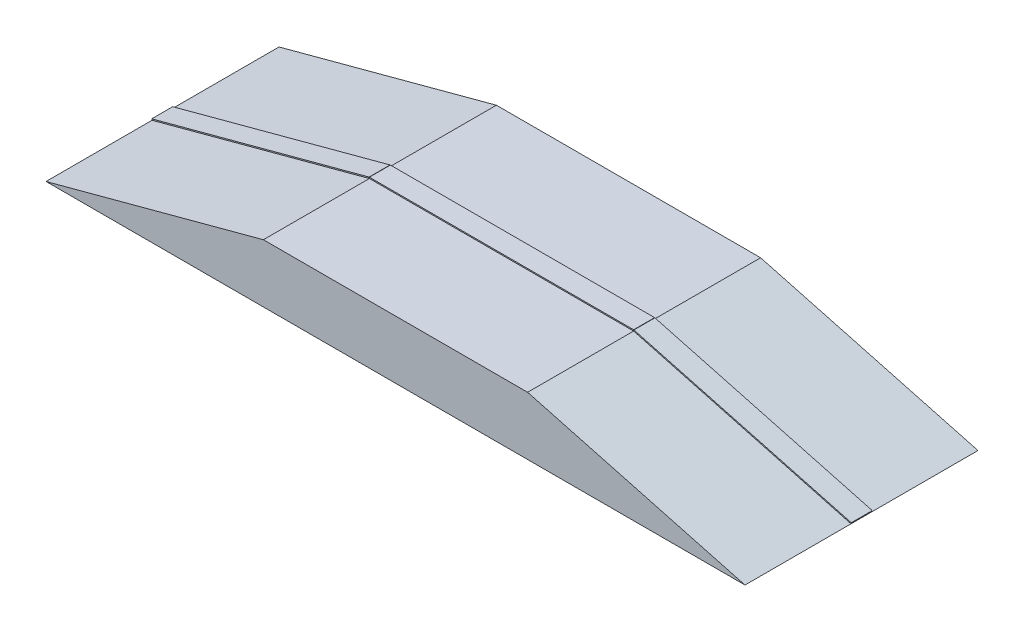
ISO-10303-21;
HEADER;
FILE_DESCRIPTION(('STEP AP214'),'2;1');
FILE_NAME('part.step','',(''),(''),'','','');
FILE_SCHEMA(('AUTOMOTIVE_DESIGN { 1 0 10303 214 1 1 1 1 }'));
ENDSEC;
DATA;
#1=APPLICATION_CONTEXT('core data for automotive mechanical design processes');
#2=APPLICATION_PROTOCOL_DEFINITION('international standard','automotive_design',2000,#1);
#3=PRODUCT_CONTEXT('',#1,'mechanical');
#4=PRODUCT('Part','Part','',(#3));
#5=PRODUCT_RELATED_PRODUCT_CATEGORY('part','',(#4));
#6=PRODUCT_DEFINITION_FORMATION('','',#4);
#7=PRODUCT_DEFINITION_CONTEXT('part definition',#1,'design');
#8=PRODUCT_DEFINITION('design','',#6,#7);
#9=PRODUCT_DEFINITION_SHAPE('','',#8);
#10=(LENGTH_UNIT() NAMED_UNIT(*) SI_UNIT(.MILLI.,.METRE.));
#11=(NAMED_UNIT(*) PLANE_ANGLE_UNIT() SI_UNIT($,.RADIAN.));
#12=(NAMED_UNIT(*) SI_UNIT($,.STERADIAN.) SOLID_ANGLE_UNIT());
#13=UNCERTAINTY_MEASURE_WITH_UNIT(LENGTH_MEASURE(1.E-05),#10,'distance_accuracy_value','');
#14=(GEOMETRIC_REPRESENTATION_CONTEXT(3) GLOBAL_UNCERTAINTY_ASSIGNED_CONTEXT((#13)) GLOBAL_UNIT_ASSIGNED_CONTEXT((#10,
#11,#12)) REPRESENTATION_CONTEXT('',''));
#15=CARTESIAN_POINT('',(0.,0.,0.));
#16=DIRECTION('',(0.,0.,1.));
#17=DIRECTION('',(1.,0.,0.));
#18=AXIS2_PLACEMENT_3D('',#15,#16,#17);
#19=CARTESIAN_POINT('',(186.343721333346,50.965925826289,-8.99999999999993));
#20=DIRECTION('',(-0.96592582628907,-0.258819045102515,0.));
#21=DIRECTION('',(0.258819045102515,-0.96592582628907,0.));
#22=AXIS2_PLACEMENT_3D('',#19,#20,#21);
#23=PLANE('',#22);
#24=DIRECTION('',(0.,0.,-1.));
#25=VECTOR('',#24,1.);
#26=CARTESIAN_POINT('',(186.602540378448,49.9999999999999,-8.99999999999993));
#27=LINE('',#26,#25);
#28=CARTESIAN_POINT('',(186.602540378448,49.9999999999999,9.00000000000008));
#29=VERTEX_POINT('',#28);
#30=CARTESIAN_POINT('',(186.602540378448,49.9999999999999,-8.99999999999993));
#31=VERTEX_POINT('',#30);
#32=EDGE_CURVE('E108',#29,#31,#27,.T.);
#33=ORIENTED_EDGE('',*,*,#32,.T.);
#34=DIRECTION('',(0.258819045102515,-0.96592582628907,0.));
#35=VECTOR('',#34,1.);
#36=CARTESIAN_POINT('',(186.343721333346,50.965925826289,-8.99999999999993));
#37=LINE('',#36,#35);
#38=CARTESIAN_POINT('',(186.343721333346,50.965925826289,-8.99999999999993));
#39=VERTEX_POINT('',#38);
#40=EDGE_CURVE('E12',#39,#31,#37,.T.);
#41=ORIENTED_EDGE('',*,*,#40,.F.);
#42=DIRECTION('',(0.,0.,-1.));
#43=VECTOR('',#42,1.);
#44=CARTESIAN_POINT('',(186.343721333346,50.965925826289,-8.99999999999993));
#45=LINE('',#44,#43);
#46=CARTESIAN_POINT('',(186.343721333346,50.965925826289,9.00000000000008));
#47=VERTEX_POINT('',#46);
#48=EDGE_CURVE('E96',#47,#39,#45,.T.);
#49=ORIENTED_EDGE('',*,*,#48,.F.);
#50=DIRECTION('',(0.258819045102515,-0.96592582628907,0.));
#51=VECTOR('',#50,1.);
#52=CARTESIAN_POINT('',(186.343721333346,50.965925826289,9.00000000000008));
#53=LINE('',#52,#51);
#54=EDGE_CURVE('E104',#47,#29,#53,.T.);
#55=ORIENTED_EDGE('',*,*,#54,.T.);
#56=EDGE_LOOP('',(#33,#41,#49,#55));
#57=FACE_BOUND('',#56,.T.);
#58=ADVANCED_FACE('F45',(#57),#23,.F.);
#59=CARTESIAN_POINT('',(186.343721333346,50.965925826289,-8.99999999999993));
#60=DIRECTION('',(0.,0.,1.));
#61=DIRECTION('',(1.,0.,0.));
#62=AXIS2_PLACEMENT_3D('',#59,#60,#61);
#63=PLANE('',#62);
#64=DIRECTION('',(-0.96592582628907,-0.258819045102515,0.));
#65=VECTOR('',#64,1.);
#66=CARTESIAN_POINT('',(186.602540378448,49.9999999999999,-8.99999999999993));
#67=LINE('',#66,#65);
#68=CARTESIAN_POINT('',(0.,0.,-8.9999999999999));
#69=VERTEX_POINT('',#68);
#70=EDGE_CURVE('E100',#31,#69,#67,.T.);
#71=ORIENTED_EDGE('',*,*,#70,.T.);
#72=DIRECTION('',(0.258819045102515,-0.96592582628907,0.));
#73=VECTOR('',#72,1.);
#74=CARTESIAN_POINT('',(-0.258819045102515,0.96592582628907,-8.9999999999999));
#75=LINE('',#74,#73);
#76=CARTESIAN_POINT('',(-0.258819045102515,0.96592582628907,-8.9999999999999));
#77=VERTEX_POINT('',#76);
#78=EDGE_CURVE('E53',#77,#69,#75,.T.);
#79=ORIENTED_EDGE('',*,*,#78,.F.);
#80=DIRECTION('',(-0.96592582628907,-0.258819045102515,0.));
#81=VECTOR('',#80,1.);
#82=CARTESIAN_POINT('',(186.343721333346,50.965925826289,-8.99999999999993));
#83=LINE('',#82,#81);
#84=EDGE_CURVE('E91',#39,#77,#83,.T.);
#85=ORIENTED_EDGE('',*,*,#84,.F.);
#86=ORIENTED_EDGE('',*,*,#40,.T.);
#87=EDGE_LOOP('',(#71,#79,#85,#86));
#88=FACE_BOUND('',#87,.T.);
#89=ADVANCED_FACE('F99',(#88),#63,.F.);
#90=CARTESIAN_POINT('',(-0.258819045102515,0.96592582628907,-8.9999999999999));
#91=DIRECTION('',(0.96592582628907,0.258819045102515,0.));
#92=DIRECTION('',(-0.258819045102515,0.96592582628907,0.));
#93=AXIS2_PLACEMENT_3D('',#90,#91,#92);
#94=PLANE('',#93);
#95=DIRECTION('',(0.,0.,1.));
#96=VECTOR('',#95,1.);
#97=CARTESIAN_POINT('',(0.,0.,-8.9999999999999));
#98=LINE('',#97,#96);
#99=CARTESIAN_POINT('',(0.,0.,9.0000000000001));
#100=VERTEX_POINT('',#99);
#101=EDGE_CURVE('E78',#69,#100,#98,.T.);
#102=ORIENTED_EDGE('',*,*,#101,.T.);
#103=DIRECTION('',(0.258819045102515,-0.96592582628907,0.));
#104=VECTOR('',#103,1.);
#105=CARTESIAN_POINT('',(-0.258819045102515,0.96592582628907,9.0000000000001));
#106=LINE('',#105,#104);
#107=CARTESIAN_POINT('',(-0.258819045102515,0.96592582628907,9.0000000000001));
#108=VERTEX_POINT('',#107);
#109=EDGE_CURVE('E101',#108,#100,#106,.T.);
#110=ORIENTED_EDGE('',*,*,#109,.F.);
#111=DIRECTION('',(0.,0.,1.));
#112=VECTOR('',#111,1.);
#113=CARTESIAN_POINT('',(-0.258819045102515,0.96592582628907,-8.9999999999999));
#114=LINE('',#113,#112);
#115=EDGE_CURVE('E94',#77,#108,#114,.T.);
#116=ORIENTED_EDGE('',*,*,#115,.F.);
#117=ORIENTED_EDGE('',*,*,#78,.T.);
#118=EDGE_LOOP('',(#102,#110,#116,#117));
#119=FACE_BOUND('',#118,.T.);
#120=ADVANCED_FACE('F102',(#119),#94,.F.);
#121=CARTESIAN_POINT('',(186.343721333346,50.965925826289,9.00000000000008));
#122=DIRECTION('',(0.,0.,-1.));
#123=DIRECTION('',(-1.,0.,0.));
#124=AXIS2_PLACEMENT_3D('',#121,#122,#123);
#125=PLANE('',#124);
#126=DIRECTION('',(0.96592582628907,0.258819045102515,0.));
#127=VECTOR('',#126,1.);
#128=CARTESIAN_POINT('',(186.602540378448,49.9999999999999,9.00000000000008));
#129=LINE('',#128,#127);
#130=EDGE_CURVE('E84',#100,#29,#129,.T.);
#131=ORIENTED_EDGE('',*,*,#130,.T.);
#132=ORIENTED_EDGE('',*,*,#54,.F.);
#133=DIRECTION('',(0.96592582628907,0.258819045102515,0.));
#134=VECTOR('',#133,1.);
#135=CARTESIAN_POINT('',(186.343721333346,50.965925826289,9.00000000000008));
#136=LINE('',#135,#134);
#137=EDGE_CURVE('E61',#108,#47,#136,.T.);
#138=ORIENTED_EDGE('',*,*,#137,.F.);
#139=ORIENTED_EDGE('',*,*,#109,.T.);
#140=EDGE_LOOP('',(#131,#132,#138,#139));
#141=FACE_BOUND('',#140,.T.);
#142=ADVANCED_FACE('F115',(#141),#125,.F.);
#143=CARTESIAN_POINT('',(-0.258819045102516,0.965925826289077,0.));
#144=DIRECTION('',(0.258819045102515,-0.96592582628907,0.));
#145=DIRECTION('',(0.96592582628907,0.258819045102515,0.));
#146=AXIS2_PLACEMENT_3D('',#143,#144,#145);
#147=PLANE('',#146);
#148=ORIENTED_EDGE('',*,*,#48,.T.);
#149=ORIENTED_EDGE('',*,*,#84,.T.);
#150=ORIENTED_EDGE('',*,*,#115,.T.);
#151=ORIENTED_EDGE('',*,*,#137,.T.);
#152=EDGE_LOOP('',(#148,#149,#150,#151));
#153=FACE_BOUND('',#152,.T.);
#154=ADVANCED_FACE('F92',(#153),#147,.F.);
#155=CARTESIAN_POINT('',(0.,0.,0.));
#156=DIRECTION('',(0.258819045102515,-0.96592582628907,0.));
#157=DIRECTION('',(0.96592582628907,0.258819045102515,0.));
#158=AXIS2_PLACEMENT_3D('',#155,#156,#157);
#159=PLANE('',#158);
#160=ORIENTED_EDGE('',*,*,#32,.F.);
#161=ORIENTED_EDGE('',*,*,#130,.F.);
#162=ORIENTED_EDGE('',*,*,#101,.F.);
#163=ORIENTED_EDGE('',*,*,#70,.F.);
#164=EDGE_LOOP('',(#160,#161,#162,#163));
#165=FACE_BOUND('',#164,.T.);
#166=ADVANCED_FACE('F118',(#165),#159,.T.);
#167=CLOSED_SHELL('',(#58,#89,#120,#142,#154,#166));
#168=MANIFOLD_SOLID_BREP('B2',#167);
#169=CARTESIAN_POINT('',(413.397459621551,51.,-8.99999999999995));
#170=DIRECTION('',(-1.,0.,0.));
#171=DIRECTION('',(0.,-1.,0.));
#172=AXIS2_PLACEMENT_3D('',#169,#170,#171);
#173=PLANE('',#172);
#174=DIRECTION('',(0.,0.,-1.));
#175=VECTOR('',#174,1.);
#176=CARTESIAN_POINT('',(413.397459621551,50.,-8.99999999999995));
#177=LINE('',#176,#175);
#178=CARTESIAN_POINT('',(413.397459621551,50.,9.00000000000005));
#179=VERTEX_POINT('',#178);
#180=CARTESIAN_POINT('',(413.397459621551,50.,-8.99999999999995));
#181=VERTEX_POINT('',#180);
#182=EDGE_CURVE('E241',#179,#181,#177,.T.);
#183=ORIENTED_EDGE('',*,*,#182,.T.);
#184=DIRECTION('',(0.,-1.,0.));
#185=VECTOR('',#184,1.);
#186=CARTESIAN_POINT('',(413.397459621551,51.,-8.99999999999995));
#187=LINE('',#186,#185);
#188=CARTESIAN_POINT('',(413.397459621551,51.,-8.99999999999995));
#189=VERTEX_POINT('',#188);
#190=EDGE_CURVE('E43',#189,#181,#187,.T.);
#191=ORIENTED_EDGE('',*,*,#190,.F.);
#192=DIRECTION('',(0.,0.,-1.));
#193=VECTOR('',#192,1.);
#194=CARTESIAN_POINT('',(413.397459621551,51.,-8.99999999999995));
#195=LINE('',#194,#193);
#196=CARTESIAN_POINT('',(413.397459621551,51.,9.00000000000005));
#197=VERTEX_POINT('',#196);
#198=EDGE_CURVE('E229',#197,#189,#195,.T.);
#199=ORIENTED_EDGE('',*,*,#198,.F.);
#200=DIRECTION('',(0.,-1.,0.));
#201=VECTOR('',#200,1.);
#202=CARTESIAN_POINT('',(413.397459621551,51.,9.00000000000005));
#203=LINE('',#202,#201);
#204=EDGE_CURVE('E237',#197,#179,#203,.T.);
#205=ORIENTED_EDGE('',*,*,#204,.T.);
#206=EDGE_LOOP('',(#183,#191,#199,#205));
#207=FACE_BOUND('',#206,.T.);
#208=ADVANCED_FACE('F178',(#207),#173,.F.);
#209=CARTESIAN_POINT('',(413.397459621551,51.,-8.99999999999995));
#210=DIRECTION('',(0.,0.,1.));
#211=DIRECTION('',(1.,0.,0.));
#212=AXIS2_PLACEMENT_3D('',#209,#210,#211);
#213=PLANE('',#212);
#214=DIRECTION('',(-1.,0.,0.));
#215=VECTOR('',#214,1.);
#216=CARTESIAN_POINT('',(413.397459621551,50.,-8.99999999999995));
#217=LINE('',#216,#215);
#218=CARTESIAN_POINT('',(186.602540378449,50.,-8.99999999999993));
#219=VERTEX_POINT('',#218);
#220=EDGE_CURVE('E233',#181,#219,#217,.T.);
#221=ORIENTED_EDGE('',*,*,#220,.T.);
#222=DIRECTION('',(0.,-1.,0.));
#223=VECTOR('',#222,1.);
#224=CARTESIAN_POINT('',(186.602540378449,51.,-8.99999999999993));
#225=LINE('',#224,#223);
#226=CARTESIAN_POINT('',(186.602540378449,51.,-8.99999999999993));
#227=VERTEX_POINT('',#226);
#228=EDGE_CURVE('E186',#227,#219,#225,.T.);
#229=ORIENTED_EDGE('',*,*,#228,.F.);
#230=DIRECTION('',(-1.,0.,0.));
#231=VECTOR('',#230,1.);
#232=CARTESIAN_POINT('',(413.397459621551,51.,-8.99999999999995));
#233=LINE('',#232,#231);
#234=EDGE_CURVE('E224',#189,#227,#233,.T.);
#235=ORIENTED_EDGE('',*,*,#234,.F.);
#236=ORIENTED_EDGE('',*,*,#190,.T.);
#237=EDGE_LOOP('',(#221,#229,#235,#236));
#238=FACE_BOUND('',#237,.T.);
#239=ADVANCED_FACE('F232',(#238),#213,.F.);
#240=CARTESIAN_POINT('',(186.602540378449,51.,-8.99999999999993));
#241=DIRECTION('',(1.,0.,0.));
#242=DIRECTION('',(0.,1.,0.));
#243=AXIS2_PLACEMENT_3D('',#240,#241,#242);
#244=PLANE('',#243);
#245=DIRECTION('',(0.,0.,1.));
#246=VECTOR('',#245,1.);
#247=CARTESIAN_POINT('',(186.602540378449,50.,-8.99999999999993));
#248=LINE('',#247,#246);
#249=CARTESIAN_POINT('',(186.602540378449,50.,9.00000000000008));
#250=VERTEX_POINT('',#249);
#251=EDGE_CURVE('E211',#219,#250,#248,.T.);
#252=ORIENTED_EDGE('',*,*,#251,.T.);
#253=DIRECTION('',(0.,-1.,0.));
#254=VECTOR('',#253,1.);
#255=CARTESIAN_POINT('',(186.602540378449,51.,9.00000000000008));
#256=LINE('',#255,#254);
#257=CARTESIAN_POINT('',(186.602540378449,51.,9.00000000000008));
#258=VERTEX_POINT('',#257);
#259=EDGE_CURVE('E234',#258,#250,#256,.T.);
#260=ORIENTED_EDGE('',*,*,#259,.F.);
#261=DIRECTION('',(0.,0.,1.));
#262=VECTOR('',#261,1.);
#263=CARTESIAN_POINT('',(186.602540378449,51.,-8.99999999999993));
#264=LINE('',#263,#262);
#265=EDGE_CURVE('E227',#227,#258,#264,.T.);
#266=ORIENTED_EDGE('',*,*,#265,.F.);
#267=ORIENTED_EDGE('',*,*,#228,.T.);
#268=EDGE_LOOP('',(#252,#260,#266,#267));
#269=FACE_BOUND('',#268,.T.);
#270=ADVANCED_FACE('F235',(#269),#244,.F.);
#271=CARTESIAN_POINT('',(413.397459621551,51.,9.00000000000005));
#272=DIRECTION('',(0.,0.,-1.));
#273=DIRECTION('',(-1.,0.,0.));
#274=AXIS2_PLACEMENT_3D('',#271,#272,#273);
#275=PLANE('',#274);
#276=DIRECTION('',(1.,0.,0.));
#277=VECTOR('',#276,1.);
#278=CARTESIAN_POINT('',(413.397459621551,50.,9.00000000000005));
#279=LINE('',#278,#277);
#280=EDGE_CURVE('E217',#250,#179,#279,.T.);
#281=ORIENTED_EDGE('',*,*,#280,.T.);
#282=ORIENTED_EDGE('',*,*,#204,.F.);
#283=DIRECTION('',(1.,0.,0.));
#284=VECTOR('',#283,1.);
#285=CARTESIAN_POINT('',(413.397459621551,51.,9.00000000000005));
#286=LINE('',#285,#284);
#287=EDGE_CURVE('E194',#258,#197,#286,.T.);
#288=ORIENTED_EDGE('',*,*,#287,.F.);
#289=ORIENTED_EDGE('',*,*,#259,.T.);
#290=EDGE_LOOP('',(#281,#282,#288,#289));
#291=FACE_BOUND('',#290,.T.);
#292=ADVANCED_FACE('F248',(#291),#275,.F.);
#293=CARTESIAN_POINT('',(0.,50.9999999999999,0.));
#294=DIRECTION('',(0.,-1.,0.));
#295=DIRECTION('',(1.,0.,0.));
#296=AXIS2_PLACEMENT_3D('',#293,#294,#295);
#297=PLANE('',#296);
#298=ORIENTED_EDGE('',*,*,#198,.T.);
#299=ORIENTED_EDGE('',*,*,#234,.T.);
#300=ORIENTED_EDGE('',*,*,#265,.T.);
#301=ORIENTED_EDGE('',*,*,#287,.T.);
#302=EDGE_LOOP('',(#298,#299,#300,#301));
#303=FACE_BOUND('',#302,.T.);
#304=ADVANCED_FACE('F225',(#303),#297,.F.);
#305=CARTESIAN_POINT('',(0.,49.9999999999999,0.));
#306=DIRECTION('',(0.,-1.,0.));
#307=DIRECTION('',(1.,0.,0.));
#308=AXIS2_PLACEMENT_3D('',#305,#306,#307);
#309=PLANE('',#308);
#310=ORIENTED_EDGE('',*,*,#182,.F.);
#311=ORIENTED_EDGE('',*,*,#280,.F.);
#312=ORIENTED_EDGE('',*,*,#251,.F.);
#313=ORIENTED_EDGE('',*,*,#220,.F.);
#314=EDGE_LOOP('',(#310,#311,#312,#313));
#315=FACE_BOUND('',#314,.T.);
#316=ADVANCED_FACE('F251',(#315),#309,.T.);
#317=CLOSED_SHELL('',(#208,#239,#270,#292,#304,#316));
#318=MANIFOLD_SOLID_BREP('B6',#317);
#319=CARTESIAN_POINT('',(600.258819045102,0.96592582628907,-8.99999999999998));
#320=DIRECTION('',(-0.96592582628907,0.258819045102514,0.));
#321=DIRECTION('',(-0.258819045102514,-0.96592582628907,0.));
#322=AXIS2_PLACEMENT_3D('',#319,#320,#321);
#323=PLANE('',#322);
#324=DIRECTION('',(0.,0.,-1.));
#325=VECTOR('',#324,1.);
#326=CARTESIAN_POINT('',(600.,0.,-8.99999999999998));
#327=LINE('',#326,#325);
#328=CARTESIAN_POINT('',(600.,0.,9.00000000000002));
#329=VERTEX_POINT('',#328);
#330=CARTESIAN_POINT('',(600.,0.,-8.99999999999998));
#331=VERTEX_POINT('',#330);
#332=EDGE_CURVE('E373',#329,#331,#327,.T.);
#333=ORIENTED_EDGE('',*,*,#332,.T.);
#334=DIRECTION('',(-0.258819045102514,-0.96592582628907,0.));
#335=VECTOR('',#334,1.);
#336=CARTESIAN_POINT('',(600.258819045102,0.96592582628907,-8.99999999999998));
#337=LINE('',#336,#335);
#338=CARTESIAN_POINT('',(600.258819045102,0.96592582628907,-8.99999999999998));
#339=VERTEX_POINT('',#338);
#340=EDGE_CURVE('E176',#339,#331,#337,.T.);
#341=ORIENTED_EDGE('',*,*,#340,.F.);
#342=DIRECTION('',(0.,0.,-1.));
#343=VECTOR('',#342,1.);
#344=CARTESIAN_POINT('',(600.258819045102,0.96592582628907,-8.99999999999998));
#345=LINE('',#344,#343);
#346=CARTESIAN_POINT('',(600.258819045102,0.96592582628907,9.00000000000002));
#347=VERTEX_POINT('',#346);
#348=EDGE_CURVE('E361',#347,#339,#345,.T.);
#349=ORIENTED_EDGE('',*,*,#348,.F.);
#350=DIRECTION('',(-0.258819045102514,-0.96592582628907,0.));
#351=VECTOR('',#350,1.);
#352=CARTESIAN_POINT('',(600.258819045102,0.96592582628907,9.00000000000002));
#353=LINE('',#352,#351);
#354=EDGE_CURVE('E369',#347,#329,#353,.T.);
#355=ORIENTED_EDGE('',*,*,#354,.T.);
#356=EDGE_LOOP('',(#333,#341,#349,#355));
#357=FACE_BOUND('',#356,.T.);
#358=ADVANCED_FACE('F310',(#357),#323,.F.);
#359=CARTESIAN_POINT('',(600.258819045102,0.96592582628907,-8.99999999999998));
#360=DIRECTION('',(0.,0.,1.));
#361=DIRECTION('',(1.,0.,0.));
#362=AXIS2_PLACEMENT_3D('',#359,#360,#361);
#363=PLANE('',#362);
#364=DIRECTION('',(-0.96592582628907,0.258819045102514,0.));
#365=VECTOR('',#364,1.);
#366=CARTESIAN_POINT('',(600.,0.,-8.99999999999998));
#367=LINE('',#366,#365);
#368=CARTESIAN_POINT('',(413.397459621551,50.,-8.99999999999995));
#369=VERTEX_POINT('',#368);
#370=EDGE_CURVE('E365',#331,#369,#367,.T.);
#371=ORIENTED_EDGE('',*,*,#370,.T.);
#372=DIRECTION('',(-0.258819045102514,-0.96592582628907,0.));
#373=VECTOR('',#372,1.);
#374=CARTESIAN_POINT('',(413.656278666654,50.9659258262891,-8.99999999999995));
#375=LINE('',#374,#373);
#376=CARTESIAN_POINT('',(413.656278666654,50.9659258262891,-8.99999999999995));
#377=VERTEX_POINT('',#376);
#378=EDGE_CURVE('E318',#377,#369,#375,.T.);
#379=ORIENTED_EDGE('',*,*,#378,.F.);
#380=DIRECTION('',(-0.96592582628907,0.258819045102514,0.));
#381=VECTOR('',#380,1.);
#382=CARTESIAN_POINT('',(600.258819045102,0.96592582628907,-8.99999999999998));
#383=LINE('',#382,#381);
#384=EDGE_CURVE('E356',#339,#377,#383,.T.);
#385=ORIENTED_EDGE('',*,*,#384,.F.);
#386=ORIENTED_EDGE('',*,*,#340,.T.);
#387=EDGE_LOOP('',(#371,#379,#385,#386));
#388=FACE_BOUND('',#387,.T.);
#389=ADVANCED_FACE('F364',(#388),#363,.F.);
#390=CARTESIAN_POINT('',(413.656278666654,50.9659258262891,-8.99999999999995));
#391=DIRECTION('',(0.96592582628907,-0.258819045102514,0.));
#392=DIRECTION('',(0.258819045102514,0.96592582628907,0.));
#393=AXIS2_PLACEMENT_3D('',#390,#391,#392);
#394=PLANE('',#393);
#395=DIRECTION('',(0.,0.,1.));
#396=VECTOR('',#395,1.);
#397=CARTESIAN_POINT('',(413.397459621551,50.,-8.99999999999995));
#398=LINE('',#397,#396);
#399=CARTESIAN_POINT('',(413.397459621551,50.,9.00000000000005));
#400=VERTEX_POINT('',#399);
#401=EDGE_CURVE('E343',#369,#400,#398,.T.);
#402=ORIENTED_EDGE('',*,*,#401,.T.);
#403=DIRECTION('',(-0.258819045102514,-0.96592582628907,0.));
#404=VECTOR('',#403,1.);
#405=CARTESIAN_POINT('',(413.656278666654,50.9659258262891,9.00000000000005));
#406=LINE('',#405,#404);
#407=CARTESIAN_POINT('',(413.656278666654,50.9659258262891,9.00000000000005));
#408=VERTEX_POINT('',#407);
#409=EDGE_CURVE('E366',#408,#400,#406,.T.);
#410=ORIENTED_EDGE('',*,*,#409,.F.);
#411=DIRECTION('',(0.,0.,1.));
#412=VECTOR('',#411,1.);
#413=CARTESIAN_POINT('',(413.656278666654,50.9659258262891,-8.99999999999995));
#414=LINE('',#413,#412);
#415=EDGE_CURVE('E359',#377,#408,#414,.T.);
#416=ORIENTED_EDGE('',*,*,#415,.F.);
#417=ORIENTED_EDGE('',*,*,#378,.T.);
#418=EDGE_LOOP('',(#402,#410,#416,#417));
#419=FACE_BOUND('',#418,.T.);
#420=ADVANCED_FACE('F367',(#419),#394,.F.);
#421=CARTESIAN_POINT('',(600.258819045102,0.96592582628907,9.00000000000002));
#422=DIRECTION('',(0.,0.,-1.));
#423=DIRECTION('',(-1.,0.,0.));
#424=AXIS2_PLACEMENT_3D('',#421,#422,#423);
#425=PLANE('',#424);
#426=DIRECTION('',(0.96592582628907,-0.258819045102514,0.));
#427=VECTOR('',#426,1.);
#428=CARTESIAN_POINT('',(600.,0.,9.00000000000002));
#429=LINE('',#428,#427);
#430=EDGE_CURVE('E349',#400,#329,#429,.T.);
#431=ORIENTED_EDGE('',*,*,#430,.T.);
#432=ORIENTED_EDGE('',*,*,#354,.F.);
#433=DIRECTION('',(0.96592582628907,-0.258819045102514,0.));
#434=VECTOR('',#433,1.);
#435=CARTESIAN_POINT('',(600.258819045102,0.96592582628907,9.00000000000002));
#436=LINE('',#435,#434);
#437=EDGE_CURVE('E326',#408,#347,#436,.T.);
#438=ORIENTED_EDGE('',*,*,#437,.F.);
#439=ORIENTED_EDGE('',*,*,#409,.T.);
#440=EDGE_LOOP('',(#431,#432,#438,#439));
#441=FACE_BOUND('',#440,.T.);
#442=ADVANCED_FACE('F380',(#441),#425,.F.);
#443=CARTESIAN_POINT('',(40.4511979097689,150.965925826286,0.));
#444=DIRECTION('',(-0.258819045102514,-0.96592582628907,0.));
#445=DIRECTION('',(0.96592582628907,-0.258819045102514,0.));
#446=AXIS2_PLACEMENT_3D('',#443,#444,#445);
#447=PLANE('',#446);
#448=ORIENTED_EDGE('',*,*,#348,.T.);
#449=ORIENTED_EDGE('',*,*,#384,.T.);
#450=ORIENTED_EDGE('',*,*,#415,.T.);
#451=ORIENTED_EDGE('',*,*,#437,.T.);
#452=EDGE_LOOP('',(#448,#449,#450,#451));
#453=FACE_BOUND('',#452,.T.);
#454=ADVANCED_FACE('F357',(#453),#447,.F.);
#455=CARTESIAN_POINT('',(40.1923788646664,149.999999999997,0.));
#456=DIRECTION('',(-0.258819045102514,-0.96592582628907,0.));
#457=DIRECTION('',(0.96592582628907,-0.258819045102514,0.));
#458=AXIS2_PLACEMENT_3D('',#455,#456,#457);
#459=PLANE('',#458);
#460=ORIENTED_EDGE('',*,*,#332,.F.);
#461=ORIENTED_EDGE('',*,*,#430,.F.);
#462=ORIENTED_EDGE('',*,*,#401,.F.);
#463=ORIENTED_EDGE('',*,*,#370,.F.);
#464=EDGE_LOOP('',(#460,#461,#462,#463));
#465=FACE_BOUND('',#464,.T.);
#466=ADVANCED_FACE('F383',(#465),#459,.T.);
#467=CLOSED_SHELL('',(#358,#389,#420,#442,#454,#466));
#468=MANIFOLD_SOLID_BREP('B37',#467);
#469=CARTESIAN_POINT('',(186.602540378449,50.,100.));
#470=DIRECTION('',(0.258819045102515,-0.96592582628907,0.));
#471=DIRECTION('',(0.96592582628907,0.258819045102515,0.));
#472=AXIS2_PLACEMENT_3D('',#469,#470,#471);
#473=PLANE('',#472);
#474=DIRECTION('',(-0.96592582628907,-0.258819045102515,0.));
#475=VECTOR('',#474,1.);
#476=CARTESIAN_POINT('',(186.602540378449,50.,-100.));
#477=LINE('',#476,#475);
#478=CARTESIAN_POINT('',(186.602540378449,50.,-100.));
#479=VERTEX_POINT('',#478);
#480=CARTESIAN_POINT('',(0.,0.,-100.));
#481=VERTEX_POINT('',#480);
#482=EDGE_CURVE('E496',#479,#481,#477,.T.);
#483=ORIENTED_EDGE('',*,*,#482,.T.);
#484=DIRECTION('',(0.,0.,-1.));
#485=VECTOR('',#484,1.);
#486=CARTESIAN_POINT('',(0.,0.,100.));
#487=LINE('',#486,#485);
#488=CARTESIAN_POINT('',(0.,0.,100.));
#489=VERTEX_POINT('',#488);
#490=EDGE_CURVE('E308',#489,#481,#487,.T.);
#491=ORIENTED_EDGE('',*,*,#490,.F.);
#492=DIRECTION('',(-0.96592582628907,-0.258819045102515,0.));
#493=VECTOR('',#492,1.);
#494=CARTESIAN_POINT('',(186.602540378449,50.,100.));
#495=LINE('',#494,#493);
#496=CARTESIAN_POINT('',(186.602540378449,50.,100.));
#497=VERTEX_POINT('',#496);
#498=EDGE_CURVE('E484',#497,#489,#495,.T.);
#499=ORIENTED_EDGE('',*,*,#498,.F.);
#500=DIRECTION('',(0.,0.,-1.));
#501=VECTOR('',#500,1.);
#502=CARTESIAN_POINT('',(186.602540378449,50.,100.));
#503=LINE('',#502,#501);
#504=EDGE_CURVE('E492',#497,#479,#503,.T.);
#505=ORIENTED_EDGE('',*,*,#504,.T.);
#506=EDGE_LOOP('',(#483,#491,#499,#505));
#507=FACE_BOUND('',#506,.T.);
#508=ADVANCED_FACE('F433',(#507),#473,.F.);
#509=CARTESIAN_POINT('',(0.,0.,100.));
#510=DIRECTION('',(0.,1.,0.));
#511=DIRECTION('',(0.,0.,1.));
#512=AXIS2_PLACEMENT_3D('',#509,#510,#511);
#513=PLANE('',#512);
#514=DIRECTION('',(1.,0.,0.));
#515=VECTOR('',#514,1.);
#516=CARTESIAN_POINT('',(0.,0.,-100.));
#517=LINE('',#516,#515);
#518=CARTESIAN_POINT('',(600.,0.,-100.));
#519=VERTEX_POINT('',#518);
#520=EDGE_CURVE('E488',#481,#519,#517,.T.);
#521=ORIENTED_EDGE('',*,*,#520,.T.);
#522=DIRECTION('',(0.,0.,-1.));
#523=VECTOR('',#522,1.);
#524=CARTESIAN_POINT('',(600.,0.,100.));
#525=LINE('',#524,#523);
#526=CARTESIAN_POINT('',(600.,0.,100.));
#527=VERTEX_POINT('',#526);
#528=EDGE_CURVE('E441',#527,#519,#525,.T.);
#529=ORIENTED_EDGE('',*,*,#528,.F.);
#530=DIRECTION('',(1.,0.,0.));
#531=VECTOR('',#530,1.);
#532=CARTESIAN_POINT('',(0.,0.,100.));
#533=LINE('',#532,#531);
#534=EDGE_CURVE('E479',#489,#527,#533,.T.);
#535=ORIENTED_EDGE('',*,*,#534,.F.);
#536=ORIENTED_EDGE('',*,*,#490,.T.);
#537=EDGE_LOOP('',(#521,#529,#535,#536));
#538=FACE_BOUND('',#537,.T.);
#539=ADVANCED_FACE('F487',(#538),#513,.F.);
#540=CARTESIAN_POINT('',(600.,0.,100.));
#541=DIRECTION('',(-0.258819045102514,-0.96592582628907,0.));
#542=DIRECTION('',(0.96592582628907,-0.258819045102514,0.));
#543=AXIS2_PLACEMENT_3D('',#540,#541,#542);
#544=PLANE('',#543);
#545=DIRECTION('',(-0.96592582628907,0.258819045102514,0.));
#546=VECTOR('',#545,1.);
#547=CARTESIAN_POINT('',(600.,0.,-100.));
#548=LINE('',#547,#546);
#549=CARTESIAN_POINT('',(413.397459621551,50.,-100.));
#550=VERTEX_POINT('',#549);
#551=EDGE_CURVE('E466',#519,#550,#548,.T.);
#552=ORIENTED_EDGE('',*,*,#551,.T.);
#553=DIRECTION('',(0.,0.,-1.));
#554=VECTOR('',#553,1.);
#555=CARTESIAN_POINT('',(413.397459621551,50.,100.));
#556=LINE('',#555,#554);
#557=CARTESIAN_POINT('',(413.397459621551,50.,100.));
#558=VERTEX_POINT('',#557);
#559=EDGE_CURVE('E489',#558,#550,#556,.T.);
#560=ORIENTED_EDGE('',*,*,#559,.F.);
#561=DIRECTION('',(-0.96592582628907,0.258819045102514,0.));
#562=VECTOR('',#561,1.);
#563=CARTESIAN_POINT('',(600.,0.,100.));
#564=LINE('',#563,#562);
#565=EDGE_CURVE('E482',#527,#558,#564,.T.);
#566=ORIENTED_EDGE('',*,*,#565,.F.);
#567=ORIENTED_EDGE('',*,*,#528,.T.);
#568=EDGE_LOOP('',(#552,#560,#566,#567));
#569=FACE_BOUND('',#568,.T.);
#570=ADVANCED_FACE('F490',(#569),#544,.F.);
#571=CARTESIAN_POINT('',(413.397459621551,50.,100.));
#572=DIRECTION('',(0.,-1.,0.));
#573=DIRECTION('',(1.,0.,0.));
#574=AXIS2_PLACEMENT_3D('',#571,#572,#573);
#575=PLANE('',#574);
#576=DIRECTION('',(-1.,0.,0.));
#577=VECTOR('',#576,1.);
#578=CARTESIAN_POINT('',(413.397459621551,50.,-100.));
#579=LINE('',#578,#577);
#580=EDGE_CURVE('E472',#550,#479,#579,.T.);
#581=ORIENTED_EDGE('',*,*,#580,.T.);
#582=ORIENTED_EDGE('',*,*,#504,.F.);
#583=DIRECTION('',(-1.,0.,0.));
#584=VECTOR('',#583,1.);
#585=CARTESIAN_POINT('',(413.397459621551,50.,100.));
#586=LINE('',#585,#584);
#587=EDGE_CURVE('E449',#558,#497,#586,.T.);
#588=ORIENTED_EDGE('',*,*,#587,.F.);
#589=ORIENTED_EDGE('',*,*,#559,.T.);
#590=EDGE_LOOP('',(#581,#582,#588,#589));
#591=FACE_BOUND('',#590,.T.);
#592=ADVANCED_FACE('F503',(#591),#575,.F.);
#593=CARTESIAN_POINT('',(0.,0.,100.));
#594=DIRECTION('',(0.,0.,-1.));
#595=DIRECTION('',(-1.,0.,0.));
#596=AXIS2_PLACEMENT_3D('',#593,#594,#595);
#597=PLANE('',#596);
#598=ORIENTED_EDGE('',*,*,#498,.T.);
#599=ORIENTED_EDGE('',*,*,#534,.T.);
#600=ORIENTED_EDGE('',*,*,#565,.T.);
#601=ORIENTED_EDGE('',*,*,#587,.T.);
#602=EDGE_LOOP('',(#598,#599,#600,#601));
#603=FACE_BOUND('',#602,.T.);
#604=ADVANCED_FACE('F480',(#603),#597,.F.);
#605=CARTESIAN_POINT('',(0.,0.,-100.));
#606=DIRECTION('',(0.,0.,-1.));
#607=DIRECTION('',(-1.,0.,0.));
#608=AXIS2_PLACEMENT_3D('',#605,#606,#607);
#609=PLANE('',#608);
#610=ORIENTED_EDGE('',*,*,#482,.F.);
#611=ORIENTED_EDGE('',*,*,#580,.F.);
#612=ORIENTED_EDGE('',*,*,#551,.F.);
#613=ORIENTED_EDGE('',*,*,#520,.F.);
#614=EDGE_LOOP('',(#610,#611,#612,#613));
#615=FACE_BOUND('',#614,.T.);
#616=ADVANCED_FACE('F506',(#615),#609,.T.);
#617=CLOSED_SHELL('',(#508,#539,#570,#592,#604,#616));
#618=MANIFOLD_SOLID_BREP('B170',#617);
#619=ADVANCED_BREP_SHAPE_REPRESENTATION('',(#18,#168,#318,#468,#618),#14);
#620=SHAPE_DEFINITION_REPRESENTATION(#9,#619);
ENDSEC;
END-ISO-10303-21;
